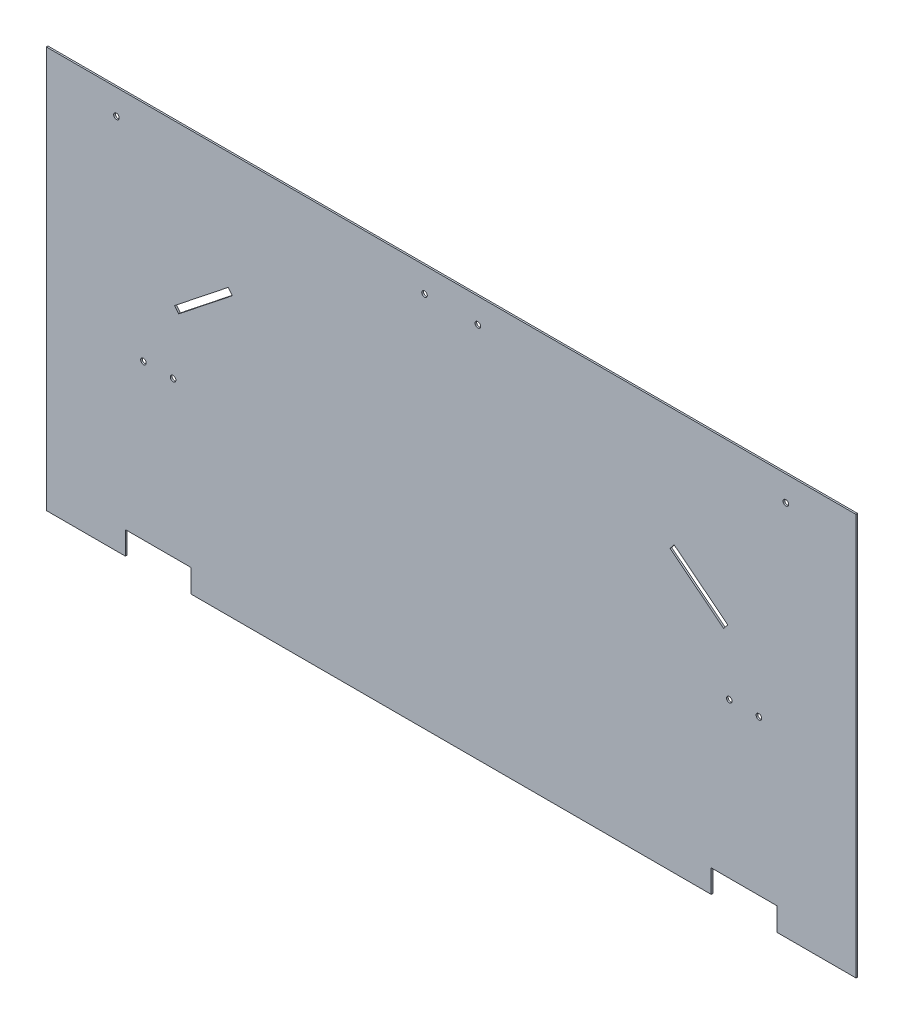
ISO-10303-21;
HEADER;
FILE_DESCRIPTION(('STEP AP214'),'2;1');
FILE_NAME('part.step','',(''),(''),'','','');
FILE_SCHEMA(('AUTOMOTIVE_DESIGN { 1 0 10303 214 1 1 1 1 }'));
ENDSEC;
DATA;
#1=APPLICATION_CONTEXT('core data for automotive mechanical design processes');
#2=APPLICATION_PROTOCOL_DEFINITION('international standard','automotive_design',2000,#1);
#3=PRODUCT_CONTEXT('',#1,'mechanical');
#4=PRODUCT('Part','Part','',(#3));
#5=PRODUCT_RELATED_PRODUCT_CATEGORY('part','',(#4));
#6=PRODUCT_DEFINITION_FORMATION('','',#4);
#7=PRODUCT_DEFINITION_CONTEXT('part definition',#1,'design');
#8=PRODUCT_DEFINITION('design','',#6,#7);
#9=PRODUCT_DEFINITION_SHAPE('','',#8);
#10=(LENGTH_UNIT() NAMED_UNIT(*) SI_UNIT(.MILLI.,.METRE.));
#11=(NAMED_UNIT(*) PLANE_ANGLE_UNIT() SI_UNIT($,.RADIAN.));
#12=(NAMED_UNIT(*) SI_UNIT($,.STERADIAN.) SOLID_ANGLE_UNIT());
#13=UNCERTAINTY_MEASURE_WITH_UNIT(LENGTH_MEASURE(1.E-05),#10,'distance_accuracy_value','');
#14=(GEOMETRIC_REPRESENTATION_CONTEXT(3) GLOBAL_UNCERTAINTY_ASSIGNED_CONTEXT((#13)) GLOBAL_UNIT_ASSIGNED_CONTEXT((#10,
#11,#12)) REPRESENTATION_CONTEXT('',''));
#15=CARTESIAN_POINT('',(0.,0.,0.));
#16=DIRECTION('',(0.,0.,1.));
#17=DIRECTION('',(1.,0.,0.));
#18=AXIS2_PLACEMENT_3D('',#15,#16,#17);
#19=CARTESIAN_POINT('',(244.058032156157,308.334030467575,3.175));
#20=DIRECTION('',(0.620640815550955,0.784095005769228,0.));
#21=DIRECTION('',(-0.784095005769228,0.620640815550955,0.));
#22=AXIS2_PLACEMENT_3D('',#19,#20,#21);
#23=PLANE('',#22);
#24=DIRECTION('',(0.784095005769228,-0.620640815550955,0.));
#25=VECTOR('',#24,1.);
#26=CARTESIAN_POINT('',(244.058032156157,308.334030467575,0.));
#27=LINE('',#26,#25);
#28=CARTESIAN_POINT('',(430.149,161.036,0.));
#29=VERTEX_POINT('',#28);
#30=CARTESIAN_POINT('',(533.712268362,79.0617610820298,0.));
#31=VERTEX_POINT('',#30);
#32=EDGE_CURVE('E274',#29,#31,#27,.T.);
#33=ORIENTED_EDGE('',*,*,#32,.T.);
#34=DIRECTION('',(0.,0.,-1.));
#35=VECTOR('',#34,1.);
#36=CARTESIAN_POINT('',(533.712268362,79.0617610820298,3.175));
#37=LINE('',#36,#35);
#38=CARTESIAN_POINT('',(533.712268362,79.0617610820298,3.175));
#39=VERTEX_POINT('',#38);
#40=EDGE_CURVE('E11',#39,#31,#37,.T.);
#41=ORIENTED_EDGE('',*,*,#40,.F.);
#42=DIRECTION('',(0.784095005769228,-0.620640815550955,0.));
#43=VECTOR('',#42,1.);
#44=CARTESIAN_POINT('',(244.058032156157,308.334030467575,3.175));
#45=LINE('',#44,#43);
#46=CARTESIAN_POINT('',(430.149,161.036,3.175));
#47=VERTEX_POINT('',#46);
#48=EDGE_CURVE('E194',#47,#39,#45,.T.);
#49=ORIENTED_EDGE('',*,*,#48,.F.);
#50=DIRECTION('',(0.,0.,-1.));
#51=VECTOR('',#50,1.);
#52=CARTESIAN_POINT('',(430.149,161.036,3.175));
#53=LINE('',#52,#51);
#54=EDGE_CURVE('E281',#47,#29,#53,.T.);
#55=ORIENTED_EDGE('',*,*,#54,.T.);
#56=EDGE_LOOP('',(#33,#41,#49,#55));
#57=FACE_BOUND('',#56,.T.);
#58=ADVANCED_FACE('F41',(#57),#23,.F.);
#59=CARTESIAN_POINT('',(289.654236205842,-229.272269385545,3.175));
#60=DIRECTION('',(0.784095005769227,-0.620640815550956,0.));
#61=DIRECTION('',(0.620640815550956,0.784095005769227,0.));
#62=AXIS2_PLACEMENT_3D('',#59,#60,#61);
#63=PLANE('',#62);
#64=DIRECTION('',(-0.620640815550956,-0.784095005769228,0.));
#65=VECTOR('',#64,1.);
#66=CARTESIAN_POINT('',(289.654236205842,-229.272269385545,0.));
#67=LINE('',#66,#65);
#68=CARTESIAN_POINT('',(525.830130004503,69.1037545087608,0.));
#69=VERTEX_POINT('',#68);
#70=EDGE_CURVE('E199',#31,#69,#67,.T.);
#71=ORIENTED_EDGE('',*,*,#70,.T.);
#72=DIRECTION('',(0.,0.,-1.));
#73=VECTOR('',#72,1.);
#74=CARTESIAN_POINT('',(525.830130004503,69.1037545087608,3.175));
#75=LINE('',#74,#73);
#76=CARTESIAN_POINT('',(525.830130004503,69.1037545087608,3.175));
#77=VERTEX_POINT('',#76);
#78=EDGE_CURVE('E51',#77,#69,#75,.T.);
#79=ORIENTED_EDGE('',*,*,#78,.F.);
#80=DIRECTION('',(-0.620640815550956,-0.784095005769228,0.));
#81=VECTOR('',#80,1.);
#82=CARTESIAN_POINT('',(289.654236205842,-229.272269385545,3.175));
#83=LINE('',#82,#81);
#84=EDGE_CURVE('E188',#39,#77,#83,.T.);
#85=ORIENTED_EDGE('',*,*,#84,.F.);
#86=ORIENTED_EDGE('',*,*,#40,.T.);
#87=EDGE_LOOP('',(#71,#79,#85,#86));
#88=FACE_BOUND('',#87,.T.);
#89=ADVANCED_FACE('F198',(#88),#63,.F.);
#90=CARTESIAN_POINT('',(236.17589379866,298.376023894306,3.175));
#91=DIRECTION('',(-0.620640815550954,-0.784095005769229,0.));
#92=DIRECTION('',(0.784095005769229,-0.620640815550954,0.));
#93=AXIS2_PLACEMENT_3D('',#90,#91,#92);
#94=PLANE('',#93);
#95=DIRECTION('',(-0.784095005769229,0.620640815550954,0.));
#96=VECTOR('',#95,1.);
#97=CARTESIAN_POINT('',(236.17589379866,298.376023894306,0.));
#98=LINE('',#97,#96);
#99=CARTESIAN_POINT('',(422.266861642503,151.077993426731,0.));
#100=VERTEX_POINT('',#99);
#101=EDGE_CURVE('E125',#69,#100,#98,.T.);
#102=ORIENTED_EDGE('',*,*,#101,.T.);
#103=DIRECTION('',(0.,0.,-1.));
#104=VECTOR('',#103,1.);
#105=CARTESIAN_POINT('',(422.266861642503,151.077993426731,3.175));
#106=LINE('',#105,#104);
#107=CARTESIAN_POINT('',(422.266861642503,151.077993426731,3.175));
#108=VERTEX_POINT('',#107);
#109=EDGE_CURVE('E200',#108,#100,#106,.T.);
#110=ORIENTED_EDGE('',*,*,#109,.F.);
#111=DIRECTION('',(-0.784095005769229,0.620640815550954,0.));
#112=VECTOR('',#111,1.);
#113=CARTESIAN_POINT('',(236.17589379866,298.376023894306,3.175));
#114=LINE('',#113,#112);
#115=EDGE_CURVE('E192',#77,#108,#114,.T.);
#116=ORIENTED_EDGE('',*,*,#115,.F.);
#117=ORIENTED_EDGE('',*,*,#78,.T.);
#118=EDGE_LOOP('',(#102,#110,#116,#117));
#119=FACE_BOUND('',#118,.T.);
#120=ADVANCED_FACE('F202',(#119),#94,.F.);
#121=CARTESIAN_POINT('',(0.,-387.35,3.175));
#122=DIRECTION('',(0.,1.,0.));
#123=DIRECTION('',(0.,0.,1.));
#124=AXIS2_PLACEMENT_3D('',#121,#122,#123);
#125=PLANE('',#124);
#126=DIRECTION('',(1.,0.,0.));
#127=VECTOR('',#126,1.);
#128=CARTESIAN_POINT('',(0.,-387.35,0.));
#129=LINE('',#128,#127);
#130=CARTESIAN_POINT('',(-501.65,-387.35,0.));
#131=VERTEX_POINT('',#130);
#132=CARTESIAN_POINT('',(501.65,-387.35,0.));
#133=VERTEX_POINT('',#132);
#134=EDGE_CURVE('E244',#131,#133,#129,.T.);
#135=ORIENTED_EDGE('',*,*,#134,.T.);
#136=DIRECTION('',(0.,0.,-1.));
#137=VECTOR('',#136,1.);
#138=CARTESIAN_POINT('',(501.65,-387.35,3.175));
#139=LINE('',#138,#137);
#140=CARTESIAN_POINT('',(501.65,-387.35,3.175));
#141=VERTEX_POINT('',#140);
#142=EDGE_CURVE('E283',#141,#133,#139,.T.);
#143=ORIENTED_EDGE('',*,*,#142,.F.);
#144=DIRECTION('',(1.,0.,0.));
#145=VECTOR('',#144,1.);
#146=CARTESIAN_POINT('',(0.,-387.35,3.175));
#147=LINE('',#146,#145);
#148=CARTESIAN_POINT('',(-501.65,-387.35,3.175));
#149=VERTEX_POINT('',#148);
#150=EDGE_CURVE('E340',#149,#141,#147,.T.);
#151=ORIENTED_EDGE('',*,*,#150,.F.);
#152=DIRECTION('',(0.,0.,-1.));
#153=VECTOR('',#152,1.);
#154=CARTESIAN_POINT('',(-501.65,-387.35,3.175));
#155=LINE('',#154,#153);
#156=EDGE_CURVE('E285',#149,#131,#155,.T.);
#157=ORIENTED_EDGE('',*,*,#156,.T.);
#158=EDGE_LOOP('',(#135,#143,#151,#157));
#159=FACE_BOUND('',#158,.T.);
#160=ADVANCED_FACE('F387',(#159),#125,.F.);
#161=CARTESIAN_POINT('',(501.65,0.,3.175));
#162=DIRECTION('',(-1.,0.,0.));
#163=DIRECTION('',(0.,0.,1.));
#164=AXIS2_PLACEMENT_3D('',#161,#162,#163);
#165=PLANE('',#164);
#166=DIRECTION('',(0.,1.,0.));
#167=VECTOR('',#166,1.);
#168=CARTESIAN_POINT('',(501.65,0.,0.));
#169=LINE('',#168,#167);
#170=CARTESIAN_POINT('',(501.65,-342.9,0.));
#171=VERTEX_POINT('',#170);
#172=EDGE_CURVE('E247',#133,#171,#169,.T.);
#173=ORIENTED_EDGE('',*,*,#172,.T.);
#174=DIRECTION('',(0.,0.,-1.));
#175=VECTOR('',#174,1.);
#176=CARTESIAN_POINT('',(501.65,-342.9,3.175));
#177=LINE('',#176,#175);
#178=CARTESIAN_POINT('',(501.65,-342.9,3.175));
#179=VERTEX_POINT('',#178);
#180=EDGE_CURVE('E308',#179,#171,#177,.T.);
#181=ORIENTED_EDGE('',*,*,#180,.F.);
#182=DIRECTION('',(0.,1.,0.));
#183=VECTOR('',#182,1.);
#184=CARTESIAN_POINT('',(501.65,0.,3.175));
#185=LINE('',#184,#183);
#186=EDGE_CURVE('E343',#141,#179,#185,.T.);
#187=ORIENTED_EDGE('',*,*,#186,.F.);
#188=ORIENTED_EDGE('',*,*,#142,.T.);
#189=EDGE_LOOP('',(#173,#181,#187,#188));
#190=FACE_BOUND('',#189,.T.);
#191=ADVANCED_FACE('F389',(#190),#165,.F.);
#192=CARTESIAN_POINT('',(0.,-342.9,3.175));
#193=DIRECTION('',(0.,-1.,0.));
#194=DIRECTION('',(0.,0.,-1.));
#195=AXIS2_PLACEMENT_3D('',#192,#193,#194);
#196=PLANE('',#195);
#197=DIRECTION('',(-1.,0.,0.));
#198=VECTOR('',#197,1.);
#199=CARTESIAN_POINT('',(0.,-342.9,0.));
#200=LINE('',#199,#198);
#201=CARTESIAN_POINT('',(628.65,-342.9,0.));
#202=VERTEX_POINT('',#201);
#203=EDGE_CURVE('E252',#202,#171,#200,.T.);
#204=ORIENTED_EDGE('',*,*,#203,.F.);
#205=DIRECTION('',(0.,0.,-1.));
#206=VECTOR('',#205,1.);
#207=CARTESIAN_POINT('',(628.65,-342.9,3.175));
#208=LINE('',#207,#206);
#209=CARTESIAN_POINT('',(628.65,-342.9,3.175));
#210=VERTEX_POINT('',#209);
#211=EDGE_CURVE('E306',#210,#202,#208,.T.);
#212=ORIENTED_EDGE('',*,*,#211,.F.);
#213=DIRECTION('',(-1.,0.,0.));
#214=VECTOR('',#213,1.);
#215=CARTESIAN_POINT('',(0.,-342.9,3.175));
#216=LINE('',#215,#214);
#217=EDGE_CURVE('E350',#210,#179,#216,.T.);
#218=ORIENTED_EDGE('',*,*,#217,.T.);
#219=ORIENTED_EDGE('',*,*,#180,.T.);
#220=EDGE_LOOP('',(#204,#212,#218,#219));
#221=FACE_BOUND('',#220,.T.);
#222=ADVANCED_FACE('F681',(#221),#196,.T.);
#223=CARTESIAN_POINT('',(628.65,0.,3.175));
#224=DIRECTION('',(-1.,0.,0.));
#225=DIRECTION('',(0.,0.,1.));
#226=AXIS2_PLACEMENT_3D('',#223,#224,#225);
#227=PLANE('',#226);
#228=DIRECTION('',(0.,1.,0.));
#229=VECTOR('',#228,1.);
#230=CARTESIAN_POINT('',(628.65,0.,0.));
#231=LINE('',#230,#229);
#232=CARTESIAN_POINT('',(628.65,-387.35,0.));
#233=VERTEX_POINT('',#232);
#234=EDGE_CURVE('E255',#233,#202,#231,.T.);
#235=ORIENTED_EDGE('',*,*,#234,.F.);
#236=DIRECTION('',(0.,0.,-1.));
#237=VECTOR('',#236,1.);
#238=CARTESIAN_POINT('',(628.65,-387.35,3.175));
#239=LINE('',#238,#237);
#240=CARTESIAN_POINT('',(628.65,-387.35,3.175));
#241=VERTEX_POINT('',#240);
#242=EDGE_CURVE('E304',#241,#233,#239,.T.);
#243=ORIENTED_EDGE('',*,*,#242,.F.);
#244=DIRECTION('',(0.,1.,0.));
#245=VECTOR('',#244,1.);
#246=CARTESIAN_POINT('',(628.65,0.,3.175));
#247=LINE('',#246,#245);
#248=EDGE_CURVE('E353',#241,#210,#247,.T.);
#249=ORIENTED_EDGE('',*,*,#248,.T.);
#250=ORIENTED_EDGE('',*,*,#211,.T.);
#251=EDGE_LOOP('',(#235,#243,#249,#250));
#252=FACE_BOUND('',#251,.T.);
#253=ADVANCED_FACE('F396',(#252),#227,.T.);
#254=CARTESIAN_POINT('',(781.05,-387.35,0.));
#255=VERTEX_POINT('',#254);
#256=EDGE_CURVE('E249',#233,#255,#129,.T.);
#257=ORIENTED_EDGE('',*,*,#256,.T.);
#258=DIRECTION('',(0.,0.,-1.));
#259=VECTOR('',#258,1.);
#260=CARTESIAN_POINT('',(781.05,-387.35,3.175));
#261=LINE('',#260,#259);
#262=CARTESIAN_POINT('',(781.05,-387.35,3.175));
#263=VERTEX_POINT('',#262);
#264=EDGE_CURVE('E302',#263,#255,#261,.T.);
#265=ORIENTED_EDGE('',*,*,#264,.F.);
#266=EDGE_CURVE('E346',#241,#263,#147,.T.);
#267=ORIENTED_EDGE('',*,*,#266,.F.);
#268=ORIENTED_EDGE('',*,*,#242,.T.);
#269=EDGE_LOOP('',(#257,#265,#267,#268));
#270=FACE_BOUND('',#269,.T.);
#271=ADVANCED_FACE('F403',(#270),#125,.F.);
#272=CARTESIAN_POINT('',(781.05,0.,3.175));
#273=DIRECTION('',(1.,0.,0.));
#274=DIRECTION('',(0.,0.,-1.));
#275=AXIS2_PLACEMENT_3D('',#272,#273,#274);
#276=PLANE('',#275);
#277=DIRECTION('',(0.,-1.,0.));
#278=VECTOR('',#277,1.);
#279=CARTESIAN_POINT('',(781.05,0.,0.));
#280=LINE('',#279,#278);
#281=CARTESIAN_POINT('',(781.05,387.35,0.));
#282=VERTEX_POINT('',#281);
#283=EDGE_CURVE('E258',#282,#255,#280,.T.);
#284=ORIENTED_EDGE('',*,*,#283,.F.);
#285=DIRECTION('',(0.,0.,-1.));
#286=VECTOR('',#285,1.);
#287=CARTESIAN_POINT('',(781.05,387.35,3.175));
#288=LINE('',#287,#286);
#289=CARTESIAN_POINT('',(781.05,387.35,3.175));
#290=VERTEX_POINT('',#289);
#291=EDGE_CURVE('E300',#290,#282,#288,.T.);
#292=ORIENTED_EDGE('',*,*,#291,.F.);
#293=DIRECTION('',(0.,-1.,0.));
#294=VECTOR('',#293,1.);
#295=CARTESIAN_POINT('',(781.05,0.,3.175));
#296=LINE('',#295,#294);
#297=EDGE_CURVE('E356',#290,#263,#296,.T.);
#298=ORIENTED_EDGE('',*,*,#297,.T.);
#299=ORIENTED_EDGE('',*,*,#264,.T.);
#300=EDGE_LOOP('',(#284,#292,#298,#299));
#301=FACE_BOUND('',#300,.T.);
#302=ADVANCED_FACE('F419',(#301),#276,.T.);
#303=CARTESIAN_POINT('',(0.,387.35,3.175));
#304=DIRECTION('',(0.,1.,0.));
#305=DIRECTION('',(0.,0.,1.));
#306=AXIS2_PLACEMENT_3D('',#303,#304,#305);
#307=PLANE('',#306);
#308=DIRECTION('',(1.,0.,0.));
#309=VECTOR('',#308,1.);
#310=CARTESIAN_POINT('',(0.,387.35,0.));
#311=LINE('',#310,#309);
#312=CARTESIAN_POINT('',(-781.05,387.35,0.));
#313=VERTEX_POINT('',#312);
#314=EDGE_CURVE('E261',#313,#282,#311,.T.);
#315=ORIENTED_EDGE('',*,*,#314,.F.);
#316=DIRECTION('',(0.,0.,-1.));
#317=VECTOR('',#316,1.);
#318=CARTESIAN_POINT('',(-781.05,387.35,3.175));
#319=LINE('',#318,#317);
#320=CARTESIAN_POINT('',(-781.05,387.35,3.175));
#321=VERTEX_POINT('',#320);
#322=EDGE_CURVE('E298',#321,#313,#319,.T.);
#323=ORIENTED_EDGE('',*,*,#322,.F.);
#324=DIRECTION('',(1.,0.,0.));
#325=VECTOR('',#324,1.);
#326=CARTESIAN_POINT('',(0.,387.35,3.175));
#327=LINE('',#326,#325);
#328=EDGE_CURVE('E359',#321,#290,#327,.T.);
#329=ORIENTED_EDGE('',*,*,#328,.T.);
#330=ORIENTED_EDGE('',*,*,#291,.T.);
#331=EDGE_LOOP('',(#315,#323,#329,#330));
#332=FACE_BOUND('',#331,.T.);
#333=ADVANCED_FACE('F421',(#332),#307,.T.);
#334=CARTESIAN_POINT('',(-781.05,0.,3.175));
#335=DIRECTION('',(1.,0.,0.));
#336=DIRECTION('',(0.,0.,-1.));
#337=AXIS2_PLACEMENT_3D('',#334,#335,#336);
#338=PLANE('',#337);
#339=DIRECTION('',(0.,-1.,0.));
#340=VECTOR('',#339,1.);
#341=CARTESIAN_POINT('',(-781.05,0.,0.));
#342=LINE('',#341,#340);
#343=CARTESIAN_POINT('',(-781.05,-387.35,0.));
#344=VERTEX_POINT('',#343);
#345=EDGE_CURVE('E264',#313,#344,#342,.T.);
#346=ORIENTED_EDGE('',*,*,#345,.T.);
#347=DIRECTION('',(0.,0.,-1.));
#348=VECTOR('',#347,1.);
#349=CARTESIAN_POINT('',(-781.05,-387.35,3.175));
#350=LINE('',#349,#348);
#351=CARTESIAN_POINT('',(-781.05,-387.35,3.175));
#352=VERTEX_POINT('',#351);
#353=EDGE_CURVE('E295',#352,#344,#350,.T.);
#354=ORIENTED_EDGE('',*,*,#353,.F.);
#355=DIRECTION('',(0.,-1.,0.));
#356=VECTOR('',#355,1.);
#357=CARTESIAN_POINT('',(-781.05,0.,3.175));
#358=LINE('',#357,#356);
#359=EDGE_CURVE('E362',#321,#352,#358,.T.);
#360=ORIENTED_EDGE('',*,*,#359,.F.);
#361=ORIENTED_EDGE('',*,*,#322,.T.);
#362=EDGE_LOOP('',(#346,#354,#360,#361));
#363=FACE_BOUND('',#362,.T.);
#364=ADVANCED_FACE('F423',(#363),#338,.F.);
#365=CARTESIAN_POINT('',(-628.65,-387.35,0.));
#366=VERTEX_POINT('',#365);
#367=EDGE_CURVE('E248',#344,#366,#129,.T.);
#368=ORIENTED_EDGE('',*,*,#367,.T.);
#369=DIRECTION('',(0.,0.,-1.));
#370=VECTOR('',#369,1.);
#371=CARTESIAN_POINT('',(-628.65,-387.35,3.175));
#372=LINE('',#371,#370);
#373=CARTESIAN_POINT('',(-628.65,-387.35,3.175));
#374=VERTEX_POINT('',#373);
#375=EDGE_CURVE('E292',#374,#366,#372,.T.);
#376=ORIENTED_EDGE('',*,*,#375,.F.);
#377=EDGE_CURVE('E345',#352,#374,#147,.T.);
#378=ORIENTED_EDGE('',*,*,#377,.F.);
#379=ORIENTED_EDGE('',*,*,#353,.T.);
#380=EDGE_LOOP('',(#368,#376,#378,#379));
#381=FACE_BOUND('',#380,.T.);
#382=ADVANCED_FACE('F411',(#381),#125,.F.);
#383=CARTESIAN_POINT('',(-628.65,0.,3.175));
#384=DIRECTION('',(-1.,0.,0.));
#385=DIRECTION('',(0.,0.,1.));
#386=AXIS2_PLACEMENT_3D('',#383,#384,#385);
#387=PLANE('',#386);
#388=DIRECTION('',(0.,1.,0.));
#389=VECTOR('',#388,1.);
#390=CARTESIAN_POINT('',(-628.65,0.,0.));
#391=LINE('',#390,#389);
#392=CARTESIAN_POINT('',(-628.65,-342.9,0.));
#393=VERTEX_POINT('',#392);
#394=EDGE_CURVE('E266',#366,#393,#391,.T.);
#395=ORIENTED_EDGE('',*,*,#394,.T.);
#396=DIRECTION('',(0.,0.,-1.));
#397=VECTOR('',#396,1.);
#398=CARTESIAN_POINT('',(-628.65,-342.9,3.175));
#399=LINE('',#398,#397);
#400=CARTESIAN_POINT('',(-628.65,-342.9,3.175));
#401=VERTEX_POINT('',#400);
#402=EDGE_CURVE('E289',#401,#393,#399,.T.);
#403=ORIENTED_EDGE('',*,*,#402,.F.);
#404=DIRECTION('',(0.,1.,0.));
#405=VECTOR('',#404,1.);
#406=CARTESIAN_POINT('',(-628.65,0.,3.175));
#407=LINE('',#406,#405);
#408=EDGE_CURVE('E364',#374,#401,#407,.T.);
#409=ORIENTED_EDGE('',*,*,#408,.F.);
#410=ORIENTED_EDGE('',*,*,#375,.T.);
#411=EDGE_LOOP('',(#395,#403,#409,#410));
#412=FACE_BOUND('',#411,.T.);
#413=ADVANCED_FACE('F414',(#412),#387,.F.);
#414=CARTESIAN_POINT('',(0.,-342.9,3.175));
#415=DIRECTION('',(0.,1.,0.));
#416=DIRECTION('',(0.,0.,1.));
#417=AXIS2_PLACEMENT_3D('',#414,#415,#416);
#418=PLANE('',#417);
#419=DIRECTION('',(1.,0.,0.));
#420=VECTOR('',#419,1.);
#421=CARTESIAN_POINT('',(0.,-342.9,0.));
#422=LINE('',#421,#420);
#423=CARTESIAN_POINT('',(-501.65,-342.9,0.));
#424=VERTEX_POINT('',#423);
#425=EDGE_CURVE('E268',#393,#424,#422,.T.);
#426=ORIENTED_EDGE('',*,*,#425,.T.);
#427=DIRECTION('',(0.,0.,-1.));
#428=VECTOR('',#427,1.);
#429=CARTESIAN_POINT('',(-501.65,-342.9,3.175));
#430=LINE('',#429,#428);
#431=CARTESIAN_POINT('',(-501.65,-342.9,3.175));
#432=VERTEX_POINT('',#431);
#433=EDGE_CURVE('E287',#432,#424,#430,.T.);
#434=ORIENTED_EDGE('',*,*,#433,.F.);
#435=DIRECTION('',(1.,0.,0.));
#436=VECTOR('',#435,1.);
#437=CARTESIAN_POINT('',(0.,-342.9,3.175));
#438=LINE('',#437,#436);
#439=EDGE_CURVE('E366',#401,#432,#438,.T.);
#440=ORIENTED_EDGE('',*,*,#439,.F.);
#441=ORIENTED_EDGE('',*,*,#402,.T.);
#442=EDGE_LOOP('',(#426,#434,#440,#441));
#443=FACE_BOUND('',#442,.T.);
#444=ADVANCED_FACE('F381',(#443),#418,.F.);
#445=CARTESIAN_POINT('',(-244.496228467148,308.277853284672,3.175));
#446=DIRECTION('',(0.621394711002035,-0.783497679089541,0.));
#447=DIRECTION('',(0.783497679089541,0.621394711002035,0.));
#448=AXIS2_PLACEMENT_3D('',#445,#446,#447);
#449=PLANE('',#448);
#450=DIRECTION('',(-0.783497679089541,-0.621394711002035,0.));
#451=VECTOR('',#450,1.);
#452=CARTESIAN_POINT('',(-244.496228467148,308.277853284672,0.));
#453=LINE('',#452,#451);
#454=CARTESIAN_POINT('',(-430.149,161.036,0.));
#455=VERTEX_POINT('',#454);
#456=CARTESIAN_POINT('',(-533.633373454147,78.9621865708511,0.));
#457=VERTEX_POINT('',#456);
#458=EDGE_CURVE('E232',#455,#457,#453,.T.);
#459=ORIENTED_EDGE('',*,*,#458,.F.);
#460=DIRECTION('',(0.,0.,-1.));
#461=VECTOR('',#460,1.);
#462=CARTESIAN_POINT('',(-430.149,161.036,3.175));
#463=LINE('',#462,#461);
#464=CARTESIAN_POINT('',(-430.149,161.036,3.175));
#465=VERTEX_POINT('',#464);
#466=EDGE_CURVE('E45',#465,#455,#463,.T.);
#467=ORIENTED_EDGE('',*,*,#466,.F.);
#468=DIRECTION('',(-0.783497679089541,-0.621394711002035,0.));
#469=VECTOR('',#468,1.);
#470=CARTESIAN_POINT('',(-244.496228467148,308.277853284672,3.175));
#471=LINE('',#470,#469);
#472=CARTESIAN_POINT('',(-533.633373454147,78.9621865708511,3.175));
#473=VERTEX_POINT('',#472);
#474=EDGE_CURVE('E793',#465,#473,#471,.T.);
#475=ORIENTED_EDGE('',*,*,#474,.T.);
#476=DIRECTION('',(0.,0.,-1.));
#477=VECTOR('',#476,1.);
#478=CARTESIAN_POINT('',(-533.633373454147,78.9621865708511,3.175));
#479=LINE('',#478,#477);
#480=EDGE_CURVE('E204',#473,#457,#479,.T.);
#481=ORIENTED_EDGE('',*,*,#480,.T.);
#482=EDGE_LOOP('',(#459,#467,#475,#481));
#483=FACE_BOUND('',#482,.T.);
#484=ADVANCED_FACE('F324',(#483),#449,.T.);
#485=CARTESIAN_POINT('',(-185.652771532851,-147.241853284672,3.175));
#486=DIRECTION('',(-0.78349767908954,-0.621394711002036,0.));
#487=DIRECTION('',(0.621394711002036,-0.78349767908954,0.));
#488=AXIS2_PLACEMENT_3D('',#485,#486,#487);
#489=PLANE('',#488);
#490=DIRECTION('',(-0.621394711002036,0.78349767908954,0.));
#491=VECTOR('',#490,1.);
#492=CARTESIAN_POINT('',(-185.652771532851,-147.241853284672,0.));
#493=LINE('',#492,#491);
#494=CARTESIAN_POINT('',(-422.257287170274,151.085579475563,0.));
#495=VERTEX_POINT('',#494);
#496=EDGE_CURVE('E235',#495,#455,#493,.T.);
#497=ORIENTED_EDGE('',*,*,#496,.F.);
#498=DIRECTION('',(0.,0.,-1.));
#499=VECTOR('',#498,1.);
#500=CARTESIAN_POINT('',(-422.257287170274,151.085579475563,3.175));
#501=LINE('',#500,#499);
#502=CARTESIAN_POINT('',(-422.257287170274,151.085579475563,3.175));
#503=VERTEX_POINT('',#502);
#504=EDGE_CURVE('E314',#503,#495,#501,.T.);
#505=ORIENTED_EDGE('',*,*,#504,.F.);
#506=DIRECTION('',(-0.621394711002036,0.78349767908954,0.));
#507=VECTOR('',#506,1.);
#508=CARTESIAN_POINT('',(-185.652771532851,-147.241853284672,3.175));
#509=LINE('',#508,#507);
#510=EDGE_CURVE('E323',#503,#465,#509,.T.);
#511=ORIENTED_EDGE('',*,*,#510,.T.);
#512=ORIENTED_EDGE('',*,*,#466,.T.);
#513=EDGE_LOOP('',(#497,#505,#511,#512));
#514=FACE_BOUND('',#513,.T.);
#515=ADVANCED_FACE('F321',(#514),#489,.T.);
#516=CARTESIAN_POINT('',(-236.604515637422,298.327432760235,3.175));
#517=DIRECTION('',(-0.621394711002035,0.783497679089541,0.));
#518=DIRECTION('',(-0.783497679089541,-0.621394711002035,0.));
#519=AXIS2_PLACEMENT_3D('',#516,#517,#518);
#520=PLANE('',#519);
#521=DIRECTION('',(0.783497679089541,0.621394711002035,0.));
#522=VECTOR('',#521,1.);
#523=CARTESIAN_POINT('',(-236.604515637422,298.327432760235,0.));
#524=LINE('',#523,#522);
#525=CARTESIAN_POINT('',(-525.741660624421,69.011766046414,0.));
#526=VERTEX_POINT('',#525);
#527=EDGE_CURVE('E238',#526,#495,#524,.T.);
#528=ORIENTED_EDGE('',*,*,#527,.F.);
#529=DIRECTION('',(0.,0.,-1.));
#530=VECTOR('',#529,1.);
#531=CARTESIAN_POINT('',(-525.741660624421,69.011766046414,3.175));
#532=LINE('',#531,#530);
#533=CARTESIAN_POINT('',(-525.741660624421,69.011766046414,3.175));
#534=VERTEX_POINT('',#533);
#535=EDGE_CURVE('E313',#534,#526,#532,.T.);
#536=ORIENTED_EDGE('',*,*,#535,.F.);
#537=DIRECTION('',(0.783497679089541,0.621394711002035,0.));
#538=VECTOR('',#537,1.);
#539=CARTESIAN_POINT('',(-236.604515637422,298.327432760235,3.175));
#540=LINE('',#539,#538);
#541=EDGE_CURVE('E331',#534,#503,#540,.T.);
#542=ORIENTED_EDGE('',*,*,#541,.T.);
#543=ORIENTED_EDGE('',*,*,#504,.T.);
#544=EDGE_LOOP('',(#528,#536,#542,#543));
#545=FACE_BOUND('',#544,.T.);
#546=ADVANCED_FACE('F329',(#545),#520,.T.);
#547=CARTESIAN_POINT('',(-501.65,0.,3.175));
#548=DIRECTION('',(-1.,0.,0.));
#549=DIRECTION('',(0.,0.,1.));
#550=AXIS2_PLACEMENT_3D('',#547,#548,#549);
#551=PLANE('',#550);
#552=DIRECTION('',(0.,1.,0.));
#553=VECTOR('',#552,1.);
#554=CARTESIAN_POINT('',(-501.65,0.,0.));
#555=LINE('',#554,#553);
#556=EDGE_CURVE('E271',#131,#424,#555,.T.);
#557=ORIENTED_EDGE('',*,*,#556,.F.);
#558=ORIENTED_EDGE('',*,*,#156,.F.);
#559=DIRECTION('',(0.,1.,0.));
#560=VECTOR('',#559,1.);
#561=CARTESIAN_POINT('',(-501.65,0.,3.175));
#562=LINE('',#561,#560);
#563=EDGE_CURVE('E368',#149,#432,#562,.T.);
#564=ORIENTED_EDGE('',*,*,#563,.T.);
#565=ORIENTED_EDGE('',*,*,#433,.T.);
#566=EDGE_LOOP('',(#557,#558,#564,#565));
#567=FACE_BOUND('',#566,.T.);
#568=ADVANCED_FACE('F373',(#567),#551,.T.);
#569=CARTESIAN_POINT('',(-289.137144986991,-229.315666713822,3.175));
#570=DIRECTION('',(0.783497679089532,0.621394711002046,0.));
#571=DIRECTION('',(-0.621394711002046,0.783497679089533,0.));
#572=AXIS2_PLACEMENT_3D('',#569,#570,#571);
#573=PLANE('',#572);
#574=DIRECTION('',(0.621394711002046,-0.783497679089532,0.));
#575=VECTOR('',#574,1.);
#576=CARTESIAN_POINT('',(-289.137144986991,-229.315666713822,0.));
#577=LINE('',#576,#575);
#578=EDGE_CURVE('E241',#457,#526,#577,.T.);
#579=ORIENTED_EDGE('',*,*,#578,.F.);
#580=ORIENTED_EDGE('',*,*,#480,.F.);
#581=DIRECTION('',(0.621394711002046,-0.783497679089532,0.));
#582=VECTOR('',#581,1.);
#583=CARTESIAN_POINT('',(-289.137144986991,-229.315666713822,3.175));
#584=LINE('',#583,#582);
#585=EDGE_CURVE('E337',#473,#534,#584,.T.);
#586=ORIENTED_EDGE('',*,*,#585,.T.);
#587=ORIENTED_EDGE('',*,*,#535,.T.);
#588=EDGE_LOOP('',(#579,#580,#586,#587));
#589=FACE_BOUND('',#588,.T.);
#590=ADVANCED_FACE('F339',(#589),#573,.T.);
#591=CARTESIAN_POINT('',(-51.4349999999999,339.459169182324,3.175));
#592=DIRECTION('',(0.,0.,-1.));
#593=DIRECTION('',(-1.,0.,0.));
#594=AXIS2_PLACEMENT_3D('',#591,#592,#593);
#595=CYLINDRICAL_SURFACE('',#594,5.3578125);
#596=CARTESIAN_POINT('',(-51.4349999999999,339.459169182324,3.175));
#597=DIRECTION('',(0.,0.,1.));
#598=DIRECTION('',(1.,0.,0.));
#599=AXIS2_PLACEMENT_3D('',#596,#597,#598);
#600=CIRCLE('',#599,5.3578125);
#601=CARTESIAN_POINT('',(-46.0771874999999,339.459169182324,3.175));
#602=VERTEX_POINT('',#601);
#603=EDGE_CURVE('E792',#602,#602,#600,.T.);
#604=ORIENTED_EDGE('',*,*,#603,.T.);
#605=EDGE_LOOP('',(#604));
#606=FACE_BOUND('',#605,.T.);
#607=CARTESIAN_POINT('',(-51.4349999999999,339.459169182324,0.));
#608=DIRECTION('',(0.,0.,1.));
#609=DIRECTION('',(1.,0.,0.));
#610=AXIS2_PLACEMENT_3D('',#607,#608,#609);
#611=CIRCLE('',#610,5.3578125);
#612=CARTESIAN_POINT('',(-46.0771874999999,339.459169182324,0.));
#613=VERTEX_POINT('',#612);
#614=EDGE_CURVE('E229',#613,#613,#611,.T.);
#615=ORIENTED_EDGE('',*,*,#614,.F.);
#616=EDGE_LOOP('',(#615));
#617=FACE_BOUND('',#616,.T.);
#618=ADVANCED_FACE('F482',(#606,#617),#595,.F.);
#619=CARTESIAN_POINT('',(51.4350000000001,339.338450693562,3.175));
#620=DIRECTION('',(0.,0.,-1.));
#621=DIRECTION('',(-1.,0.,0.));
#622=AXIS2_PLACEMENT_3D('',#619,#620,#621);
#623=CYLINDRICAL_SURFACE('',#622,5.3578125);
#624=CARTESIAN_POINT('',(51.4350000000001,339.338450693562,3.175));
#625=DIRECTION('',(0.,0.,1.));
#626=DIRECTION('',(1.,0.,0.));
#627=AXIS2_PLACEMENT_3D('',#624,#625,#626);
#628=CIRCLE('',#627,5.3578125);
#629=CARTESIAN_POINT('',(56.7928125000001,339.338450693562,3.175));
#630=VERTEX_POINT('',#629);
#631=EDGE_CURVE('E789',#630,#630,#628,.T.);
#632=ORIENTED_EDGE('',*,*,#631,.T.);
#633=EDGE_LOOP('',(#632));
#634=FACE_BOUND('',#633,.T.);
#635=CARTESIAN_POINT('',(51.4350000000001,339.338450693562,0.));
#636=DIRECTION('',(0.,0.,1.));
#637=DIRECTION('',(1.,0.,0.));
#638=AXIS2_PLACEMENT_3D('',#635,#636,#637);
#639=CIRCLE('',#638,5.3578125);
#640=CARTESIAN_POINT('',(56.7928125000001,339.338450693562,0.));
#641=VERTEX_POINT('',#640);
#642=EDGE_CURVE('E226',#641,#641,#639,.T.);
#643=ORIENTED_EDGE('',*,*,#642,.F.);
#644=EDGE_LOOP('',(#643));
#645=FACE_BOUND('',#644,.T.);
#646=ADVANCED_FACE('F489',(#634,#645),#623,.F.);
#647=CARTESIAN_POINT('',(-645.795,339.09,3.175));
#648=DIRECTION('',(0.,0.,-1.));
#649=DIRECTION('',(-1.,0.,0.));
#650=AXIS2_PLACEMENT_3D('',#647,#648,#649);
#651=CYLINDRICAL_SURFACE('',#650,5.35781249999997);
#652=CARTESIAN_POINT('',(-645.795,339.09,3.175));
#653=DIRECTION('',(0.,0.,1.));
#654=DIRECTION('',(1.,0.,0.));
#655=AXIS2_PLACEMENT_3D('',#652,#653,#654);
#656=CIRCLE('',#655,5.35781249999997);
#657=CARTESIAN_POINT('',(-640.4371875,339.09,3.175));
#658=VERTEX_POINT('',#657);
#659=EDGE_CURVE('E785',#658,#658,#656,.T.);
#660=ORIENTED_EDGE('',*,*,#659,.T.);
#661=EDGE_LOOP('',(#660));
#662=FACE_BOUND('',#661,.T.);
#663=CARTESIAN_POINT('',(-645.795,339.09,0.));
#664=DIRECTION('',(0.,0.,1.));
#665=DIRECTION('',(1.,0.,0.));
#666=AXIS2_PLACEMENT_3D('',#663,#664,#665);
#667=CIRCLE('',#666,5.35781249999997);
#668=CARTESIAN_POINT('',(-640.4371875,339.09,0.));
#669=VERTEX_POINT('',#668);
#670=EDGE_CURVE('E223',#669,#669,#667,.T.);
#671=ORIENTED_EDGE('',*,*,#670,.F.);
#672=EDGE_LOOP('',(#671));
#673=FACE_BOUND('',#672,.T.);
#674=ADVANCED_FACE('F497',(#662,#673),#651,.F.);
#675=CARTESIAN_POINT('',(645.795,339.09,3.175));
#676=DIRECTION('',(0.,0.,-1.));
#677=DIRECTION('',(-1.,0.,0.));
#678=AXIS2_PLACEMENT_3D('',#675,#676,#677);
#679=CYLINDRICAL_SURFACE('',#678,5.35781249999997);
#680=CARTESIAN_POINT('',(645.795,339.09,3.175));
#681=DIRECTION('',(0.,0.,1.));
#682=DIRECTION('',(1.,0.,0.));
#683=AXIS2_PLACEMENT_3D('',#680,#681,#682);
#684=CIRCLE('',#683,5.35781249999997);
#685=CARTESIAN_POINT('',(651.1528125,339.09,3.175));
#686=VERTEX_POINT('',#685);
#687=EDGE_CURVE('E781',#686,#686,#684,.T.);
#688=ORIENTED_EDGE('',*,*,#687,.T.);
#689=EDGE_LOOP('',(#688));
#690=FACE_BOUND('',#689,.T.);
#691=CARTESIAN_POINT('',(645.795,339.09,0.));
#692=DIRECTION('',(0.,0.,1.));
#693=DIRECTION('',(1.,0.,0.));
#694=AXIS2_PLACEMENT_3D('',#691,#692,#693);
#695=CIRCLE('',#694,5.35781249999997);
#696=CARTESIAN_POINT('',(651.1528125,339.09,0.));
#697=VERTEX_POINT('',#696);
#698=EDGE_CURVE('E220',#697,#697,#695,.T.);
#699=ORIENTED_EDGE('',*,*,#698,.F.);
#700=EDGE_LOOP('',(#699));
#701=FACE_BOUND('',#700,.T.);
#702=ADVANCED_FACE('F505',(#690,#701),#679,.F.);
#703=CARTESIAN_POINT('',(536.575000000016,-44.45,3.175));
#704=DIRECTION('',(0.,0.,-1.));
#705=DIRECTION('',(-1.,0.,0.));
#706=AXIS2_PLACEMENT_3D('',#703,#704,#705);
#707=CYLINDRICAL_SURFACE('',#706,5.35781249996267);
#708=CARTESIAN_POINT('',(536.575000000016,-44.45,3.175));
#709=DIRECTION('',(0.,0.,1.));
#710=DIRECTION('',(1.,0.,0.));
#711=AXIS2_PLACEMENT_3D('',#708,#709,#710);
#712=CIRCLE('',#711,5.35781249996267);
#713=CARTESIAN_POINT('',(541.932812499979,-44.45,3.175));
#714=VERTEX_POINT('',#713);
#715=EDGE_CURVE('E777',#714,#714,#712,.T.);
#716=ORIENTED_EDGE('',*,*,#715,.T.);
#717=EDGE_LOOP('',(#716));
#718=FACE_BOUND('',#717,.T.);
#719=CARTESIAN_POINT('',(536.575000000016,-44.45,0.));
#720=DIRECTION('',(0.,0.,1.));
#721=DIRECTION('',(1.,0.,0.));
#722=AXIS2_PLACEMENT_3D('',#719,#720,#721);
#723=CIRCLE('',#722,5.35781249996267);
#724=CARTESIAN_POINT('',(541.932812499979,-44.45,0.));
#725=VERTEX_POINT('',#724);
#726=EDGE_CURVE('E217',#725,#725,#723,.T.);
#727=ORIENTED_EDGE('',*,*,#726,.F.);
#728=EDGE_LOOP('',(#727));
#729=FACE_BOUND('',#728,.T.);
#730=ADVANCED_FACE('F513',(#718,#729),#707,.F.);
#731=CARTESIAN_POINT('',(593.725000000016,-44.45,3.175));
#732=DIRECTION('',(0.,0.,-1.));
#733=DIRECTION('',(-1.,0.,0.));
#734=AXIS2_PLACEMENT_3D('',#731,#732,#733);
#735=CYLINDRICAL_SURFACE('',#734,5.35781249996267);
#736=CARTESIAN_POINT('',(593.725000000016,-44.45,3.175));
#737=DIRECTION('',(0.,0.,1.));
#738=DIRECTION('',(1.,0.,0.));
#739=AXIS2_PLACEMENT_3D('',#736,#737,#738);
#740=CIRCLE('',#739,5.35781249996267);
#741=CARTESIAN_POINT('',(599.082812499979,-44.45,3.175));
#742=VERTEX_POINT('',#741);
#743=EDGE_CURVE('E773',#742,#742,#740,.T.);
#744=ORIENTED_EDGE('',*,*,#743,.T.);
#745=EDGE_LOOP('',(#744));
#746=FACE_BOUND('',#745,.T.);
#747=CARTESIAN_POINT('',(593.725000000016,-44.45,0.));
#748=DIRECTION('',(0.,0.,1.));
#749=DIRECTION('',(1.,0.,0.));
#750=AXIS2_PLACEMENT_3D('',#747,#748,#749);
#751=CIRCLE('',#750,5.35781249996267);
#752=CARTESIAN_POINT('',(599.082812499979,-44.45,0.));
#753=VERTEX_POINT('',#752);
#754=EDGE_CURVE('E214',#753,#753,#751,.T.);
#755=ORIENTED_EDGE('',*,*,#754,.F.);
#756=EDGE_LOOP('',(#755));
#757=FACE_BOUND('',#756,.T.);
#758=ADVANCED_FACE('F521',(#746,#757),#735,.F.);
#759=CARTESIAN_POINT('',(-593.724999999984,-44.45,3.175));
#760=DIRECTION('',(0.,0.,-1.));
#761=DIRECTION('',(-1.,0.,0.));
#762=AXIS2_PLACEMENT_3D('',#759,#760,#761);
#763=CYLINDRICAL_SURFACE('',#762,5.35781249998341);
#764=CARTESIAN_POINT('',(-593.724999999984,-44.45,3.175));
#765=DIRECTION('',(0.,0.,1.));
#766=DIRECTION('',(1.,0.,0.));
#767=AXIS2_PLACEMENT_3D('',#764,#765,#766);
#768=CIRCLE('',#767,5.35781249998341);
#769=CARTESIAN_POINT('',(-588.3671875,-44.45,3.175));
#770=VERTEX_POINT('',#769);
#771=EDGE_CURVE('E769',#770,#770,#768,.T.);
#772=ORIENTED_EDGE('',*,*,#771,.T.);
#773=EDGE_LOOP('',(#772));
#774=FACE_BOUND('',#773,.T.);
#775=CARTESIAN_POINT('',(-593.724999999984,-44.45,0.));
#776=DIRECTION('',(0.,0.,1.));
#777=DIRECTION('',(1.,0.,0.));
#778=AXIS2_PLACEMENT_3D('',#775,#776,#777);
#779=CIRCLE('',#778,5.35781249998341);
#780=CARTESIAN_POINT('',(-588.3671875,-44.45,0.));
#781=VERTEX_POINT('',#780);
#782=EDGE_CURVE('E211',#781,#781,#779,.T.);
#783=ORIENTED_EDGE('',*,*,#782,.F.);
#784=EDGE_LOOP('',(#783));
#785=FACE_BOUND('',#784,.T.);
#786=ADVANCED_FACE('F529',(#774,#785),#763,.F.);
#787=CARTESIAN_POINT('',(-536.574999999984,-44.45,3.175));
#788=DIRECTION('',(0.,0.,-1.));
#789=DIRECTION('',(-1.,0.,0.));
#790=AXIS2_PLACEMENT_3D('',#787,#788,#789);
#791=CYLINDRICAL_SURFACE('',#790,5.35781249998341);
#792=CARTESIAN_POINT('',(-536.574999999984,-44.45,3.175));
#793=DIRECTION('',(0.,0.,1.));
#794=DIRECTION('',(1.,0.,0.));
#795=AXIS2_PLACEMENT_3D('',#792,#793,#794);
#796=CIRCLE('',#795,5.35781249998341);
#797=CARTESIAN_POINT('',(-531.2171875,-44.45,3.175));
#798=VERTEX_POINT('',#797);
#799=EDGE_CURVE('E280',#798,#798,#796,.T.);
#800=ORIENTED_EDGE('',*,*,#799,.T.);
#801=EDGE_LOOP('',(#800));
#802=FACE_BOUND('',#801,.T.);
#803=CARTESIAN_POINT('',(-536.574999999984,-44.45,0.));
#804=DIRECTION('',(0.,0.,1.));
#805=DIRECTION('',(1.,0.,0.));
#806=AXIS2_PLACEMENT_3D('',#803,#804,#805);
#807=CIRCLE('',#806,5.35781249998341);
#808=CARTESIAN_POINT('',(-531.2171875,-44.45,0.));
#809=VERTEX_POINT('',#808);
#810=EDGE_CURVE('E208',#809,#809,#807,.T.);
#811=ORIENTED_EDGE('',*,*,#810,.F.);
#812=EDGE_LOOP('',(#811));
#813=FACE_BOUND('',#812,.T.);
#814=ADVANCED_FACE('F43',(#802,#813),#791,.F.);
#815=CARTESIAN_POINT('',(186.090967843843,-147.298030467575,3.175));
#816=DIRECTION('',(-0.784095005769228,0.620640815550955,0.));
#817=DIRECTION('',(-0.620640815550955,-0.784095005769228,0.));
#818=AXIS2_PLACEMENT_3D('',#815,#816,#817);
#819=PLANE('',#818);
#820=DIRECTION('',(0.620640815550955,0.784095005769228,0.));
#821=VECTOR('',#820,1.);
#822=CARTESIAN_POINT('',(186.090967843843,-147.298030467575,0.));
#823=LINE('',#822,#821);
#824=EDGE_CURVE('E131',#100,#29,#823,.T.);
#825=ORIENTED_EDGE('',*,*,#824,.T.);
#826=ORIENTED_EDGE('',*,*,#54,.F.);
#827=DIRECTION('',(0.620640815550955,0.784095005769228,0.));
#828=VECTOR('',#827,1.);
#829=CARTESIAN_POINT('',(186.090967843843,-147.298030467575,3.175));
#830=LINE('',#829,#828);
#831=EDGE_CURVE('E60',#108,#47,#830,.T.);
#832=ORIENTED_EDGE('',*,*,#831,.F.);
#833=ORIENTED_EDGE('',*,*,#109,.T.);
#834=EDGE_LOOP('',(#825,#826,#832,#833));
#835=FACE_BOUND('',#834,.T.);
#836=ADVANCED_FACE('F543',(#835),#819,.F.);
#837=CARTESIAN_POINT('',(0.,0.,3.175));
#838=DIRECTION('',(0.,0.,1.));
#839=DIRECTION('',(1.,0.,0.));
#840=AXIS2_PLACEMENT_3D('',#837,#838,#839);
#841=PLANE('',#840);
#842=ORIENTED_EDGE('',*,*,#799,.F.);
#843=EDGE_LOOP('',(#842));
#844=FACE_BOUND('',#843,.T.);
#845=ORIENTED_EDGE('',*,*,#771,.F.);
#846=EDGE_LOOP('',(#845));
#847=FACE_BOUND('',#846,.T.);
#848=ORIENTED_EDGE('',*,*,#743,.F.);
#849=EDGE_LOOP('',(#848));
#850=FACE_BOUND('',#849,.T.);
#851=ORIENTED_EDGE('',*,*,#715,.F.);
#852=EDGE_LOOP('',(#851));
#853=FACE_BOUND('',#852,.T.);
#854=ORIENTED_EDGE('',*,*,#687,.F.);
#855=EDGE_LOOP('',(#854));
#856=FACE_BOUND('',#855,.T.);
#857=ORIENTED_EDGE('',*,*,#659,.F.);
#858=EDGE_LOOP('',(#857));
#859=FACE_BOUND('',#858,.T.);
#860=ORIENTED_EDGE('',*,*,#631,.F.);
#861=EDGE_LOOP('',(#860));
#862=FACE_BOUND('',#861,.T.);
#863=ORIENTED_EDGE('',*,*,#603,.F.);
#864=EDGE_LOOP('',(#863));
#865=FACE_BOUND('',#864,.T.);
#866=ORIENTED_EDGE('',*,*,#474,.F.);
#867=ORIENTED_EDGE('',*,*,#510,.F.);
#868=ORIENTED_EDGE('',*,*,#541,.F.);
#869=ORIENTED_EDGE('',*,*,#585,.F.);
#870=EDGE_LOOP('',(#866,#867,#868,#869));
#871=FACE_BOUND('',#870,.T.);
#872=ORIENTED_EDGE('',*,*,#150,.T.);
#873=ORIENTED_EDGE('',*,*,#186,.T.);
#874=ORIENTED_EDGE('',*,*,#217,.F.);
#875=ORIENTED_EDGE('',*,*,#248,.F.);
#876=ORIENTED_EDGE('',*,*,#266,.T.);
#877=ORIENTED_EDGE('',*,*,#297,.F.);
#878=ORIENTED_EDGE('',*,*,#328,.F.);
#879=ORIENTED_EDGE('',*,*,#359,.T.);
#880=ORIENTED_EDGE('',*,*,#377,.T.);
#881=ORIENTED_EDGE('',*,*,#408,.T.);
#882=ORIENTED_EDGE('',*,*,#439,.T.);
#883=ORIENTED_EDGE('',*,*,#563,.F.);
#884=EDGE_LOOP('',(#872,#873,#874,#875,#876,#877,#878,#879,#880,#881,#882,#883));
#885=FACE_BOUND('',#884,.T.);
#886=ORIENTED_EDGE('',*,*,#48,.T.);
#887=ORIENTED_EDGE('',*,*,#84,.T.);
#888=ORIENTED_EDGE('',*,*,#115,.T.);
#889=ORIENTED_EDGE('',*,*,#831,.T.);
#890=EDGE_LOOP('',(#886,#887,#888,#889));
#891=FACE_BOUND('',#890,.T.);
#892=ADVANCED_FACE('F190',(#844,#847,#850,#853,#856,#859,#862,#865,#871,#885,#891),#841,.T.);
#893=CARTESIAN_POINT('',(0.,0.,0.));
#894=DIRECTION('',(0.,0.,1.));
#895=DIRECTION('',(1.,0.,0.));
#896=AXIS2_PLACEMENT_3D('',#893,#894,#895);
#897=PLANE('',#896);
#898=ORIENTED_EDGE('',*,*,#810,.T.);
#899=EDGE_LOOP('',(#898));
#900=FACE_BOUND('',#899,.T.);
#901=ORIENTED_EDGE('',*,*,#782,.T.);
#902=EDGE_LOOP('',(#901));
#903=FACE_BOUND('',#902,.T.);
#904=ORIENTED_EDGE('',*,*,#754,.T.);
#905=EDGE_LOOP('',(#904));
#906=FACE_BOUND('',#905,.T.);
#907=ORIENTED_EDGE('',*,*,#726,.T.);
#908=EDGE_LOOP('',(#907));
#909=FACE_BOUND('',#908,.T.);
#910=ORIENTED_EDGE('',*,*,#698,.T.);
#911=EDGE_LOOP('',(#910));
#912=FACE_BOUND('',#911,.T.);
#913=ORIENTED_EDGE('',*,*,#670,.T.);
#914=EDGE_LOOP('',(#913));
#915=FACE_BOUND('',#914,.T.);
#916=ORIENTED_EDGE('',*,*,#642,.T.);
#917=EDGE_LOOP('',(#916));
#918=FACE_BOUND('',#917,.T.);
#919=ORIENTED_EDGE('',*,*,#614,.T.);
#920=EDGE_LOOP('',(#919));
#921=FACE_BOUND('',#920,.T.);
#922=ORIENTED_EDGE('',*,*,#458,.T.);
#923=ORIENTED_EDGE('',*,*,#578,.T.);
#924=ORIENTED_EDGE('',*,*,#527,.T.);
#925=ORIENTED_EDGE('',*,*,#496,.T.);
#926=EDGE_LOOP('',(#922,#923,#924,#925));
#927=FACE_BOUND('',#926,.T.);
#928=ORIENTED_EDGE('',*,*,#134,.F.);
#929=ORIENTED_EDGE('',*,*,#556,.T.);
#930=ORIENTED_EDGE('',*,*,#425,.F.);
#931=ORIENTED_EDGE('',*,*,#394,.F.);
#932=ORIENTED_EDGE('',*,*,#367,.F.);
#933=ORIENTED_EDGE('',*,*,#345,.F.);
#934=ORIENTED_EDGE('',*,*,#314,.T.);
#935=ORIENTED_EDGE('',*,*,#283,.T.);
#936=ORIENTED_EDGE('',*,*,#256,.F.);
#937=ORIENTED_EDGE('',*,*,#234,.T.);
#938=ORIENTED_EDGE('',*,*,#203,.T.);
#939=ORIENTED_EDGE('',*,*,#172,.F.);
#940=EDGE_LOOP('',(#928,#929,#930,#931,#932,#933,#934,#935,#936,#937,#938,#939));
#941=FACE_BOUND('',#940,.T.);
#942=ORIENTED_EDGE('',*,*,#32,.F.);
#943=ORIENTED_EDGE('',*,*,#824,.F.);
#944=ORIENTED_EDGE('',*,*,#101,.F.);
#945=ORIENTED_EDGE('',*,*,#70,.F.);
#946=EDGE_LOOP('',(#942,#943,#944,#945));
#947=FACE_BOUND('',#946,.T.);
#948=ADVANCED_FACE('F327',(#900,#903,#906,#909,#912,#915,#918,#921,#927,#941,#947),#897,.F.);
#949=CLOSED_SHELL('',(#58,#89,#120,#160,#191,#222,#253,#271,#302,#333,#364,#382,#413,#444,#484,
#515,#546,#568,#590,#618,#646,#674,#702,#730,#758,#786,#814,#836,#892,#948));
#950=MANIFOLD_SOLID_BREP('B2',#949);
#951=ADVANCED_BREP_SHAPE_REPRESENTATION('',(#18,#950),#14);
#952=SHAPE_DEFINITION_REPRESENTATION(#9,#951);
ENDSEC;
END-ISO-10303-21;
